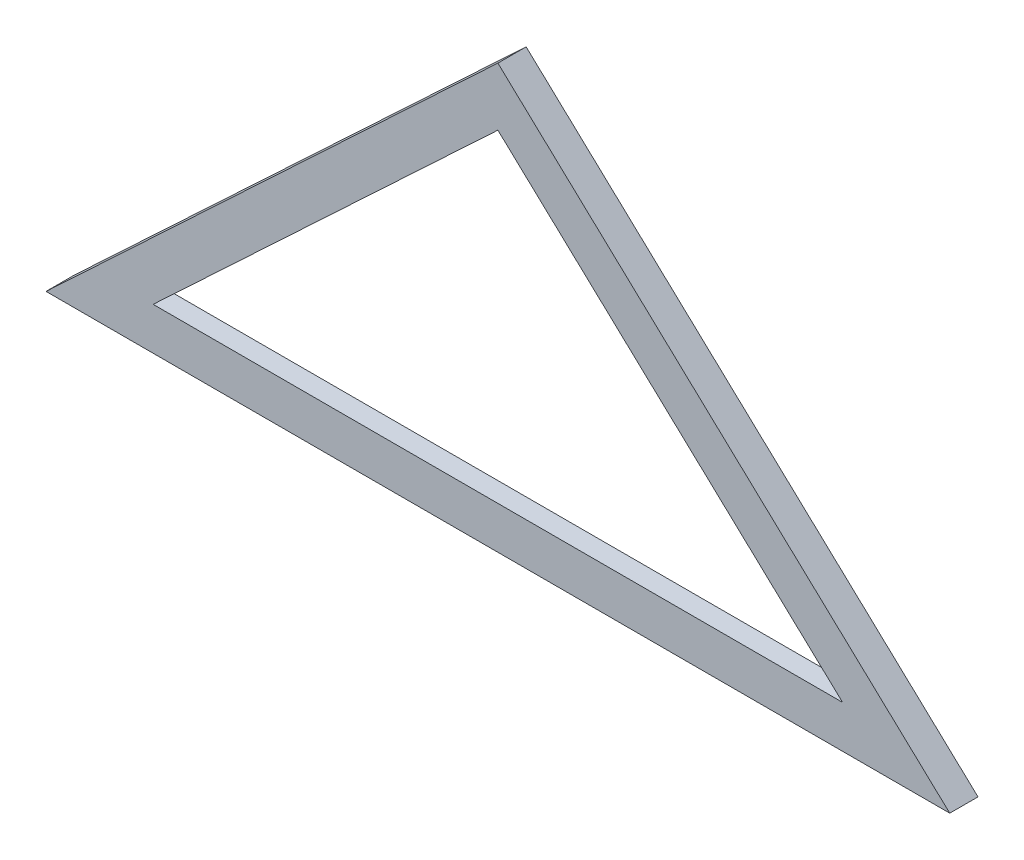
ISO-10303-21;
HEADER;
FILE_DESCRIPTION(('STEP AP214'),'2;1');
FILE_NAME('part.step','',(''),(''),'','','');
FILE_SCHEMA(('AUTOMOTIVE_DESIGN { 1 0 10303 214 1 1 1 1 }'));
ENDSEC;
DATA;
#1=APPLICATION_CONTEXT('core data for automotive mechanical design processes');
#2=APPLICATION_PROTOCOL_DEFINITION('international standard','automotive_design',2000,#1);
#3=PRODUCT_CONTEXT('',#1,'mechanical');
#4=PRODUCT('Part','Part','',(#3));
#5=PRODUCT_RELATED_PRODUCT_CATEGORY('part','',(#4));
#6=PRODUCT_DEFINITION_FORMATION('','',#4);
#7=PRODUCT_DEFINITION_CONTEXT('part definition',#1,'design');
#8=PRODUCT_DEFINITION('design','',#6,#7);
#9=PRODUCT_DEFINITION_SHAPE('','',#8);
#10=(LENGTH_UNIT() NAMED_UNIT(*) SI_UNIT(.MILLI.,.METRE.));
#11=(NAMED_UNIT(*) PLANE_ANGLE_UNIT() SI_UNIT($,.RADIAN.));
#12=(NAMED_UNIT(*) SI_UNIT($,.STERADIAN.) SOLID_ANGLE_UNIT());
#13=UNCERTAINTY_MEASURE_WITH_UNIT(LENGTH_MEASURE(1.E-05),#10,'distance_accuracy_value','');
#14=(GEOMETRIC_REPRESENTATION_CONTEXT(3) GLOBAL_UNCERTAINTY_ASSIGNED_CONTEXT((#13)) GLOBAL_UNIT_ASSIGNED_CONTEXT((#10,
#11,#12)) REPRESENTATION_CONTEXT('',''));
#15=CARTESIAN_POINT('',(0.,0.,0.));
#16=DIRECTION('',(0.,0.,1.));
#17=DIRECTION('',(1.,0.,0.));
#18=AXIS2_PLACEMENT_3D('',#15,#16,#17);
#19=CARTESIAN_POINT('',(0.,0.,10.));
#20=DIRECTION('',(0.,0.,-1.));
#21=DIRECTION('',(-1.,0.,0.));
#22=AXIS2_PLACEMENT_3D('',#19,#20,#21);
#23=PLANE('',#22);
#24=DIRECTION('',(-0.729537204140085,-0.68394112888133,0.));
#25=VECTOR('',#24,1.);
#26=CARTESIAN_POINT('',(0.,0.,10.));
#27=LINE('',#26,#25);
#28=CARTESIAN_POINT('',(160.,150.,10.));
#29=VERTEX_POINT('',#28);
#30=CARTESIAN_POINT('',(0.,0.,10.));
#31=VERTEX_POINT('',#30);
#32=EDGE_CURVE('E152',#29,#31,#27,.T.);
#33=ORIENTED_EDGE('',*,*,#32,.T.);
#34=DIRECTION('',(1.,0.,0.));
#35=VECTOR('',#34,1.);
#36=CARTESIAN_POINT('',(0.,0.,10.));
#37=LINE('',#36,#35);
#38=CARTESIAN_POINT('',(320.,0.,10.));
#39=VERTEX_POINT('',#38);
#40=EDGE_CURVE('E155',#31,#39,#37,.T.);
#41=ORIENTED_EDGE('',*,*,#40,.T.);
#42=DIRECTION('',(-0.729537204140085,0.68394112888133,0.));
#43=VECTOR('',#42,1.);
#44=CARTESIAN_POINT('',(160.,150.,10.));
#45=LINE('',#44,#43);
#46=EDGE_CURVE('E158',#39,#29,#45,.T.);
#47=ORIENTED_EDGE('',*,*,#46,.T.);
#48=EDGE_LOOP('',(#33,#41,#47));
#49=FACE_BOUND('',#48,.T.);
#50=DIRECTION('',(-0.729537204140085,-0.68394112888133,0.));
#51=VECTOR('',#50,1.);
#52=CARTESIAN_POINT('',(37.9317121994613,15.,10.));
#53=LINE('',#52,#51);
#54=CARTESIAN_POINT('',(160.,129.439019813005,10.));
#55=VERTEX_POINT('',#54);
#56=CARTESIAN_POINT('',(37.9317121994613,15.,10.));
#57=VERTEX_POINT('',#56);
#58=EDGE_CURVE('E135',#55,#57,#53,.T.);
#59=ORIENTED_EDGE('',*,*,#58,.F.);
#60=DIRECTION('',(-0.729537204140085,0.68394112888133,0.));
#61=VECTOR('',#60,1.);
#62=CARTESIAN_POINT('',(160.,129.439019813005,10.));
#63=LINE('',#62,#61);
#64=CARTESIAN_POINT('',(282.068287800539,15.,10.));
#65=VERTEX_POINT('',#64);
#66=EDGE_CURVE('E140',#65,#55,#63,.T.);
#67=ORIENTED_EDGE('',*,*,#66,.F.);
#68=DIRECTION('',(1.,0.,0.));
#69=VECTOR('',#68,1.);
#70=CARTESIAN_POINT('',(37.9317121994613,15.,10.));
#71=LINE('',#70,#69);
#72=EDGE_CURVE('E137',#57,#65,#71,.T.);
#73=ORIENTED_EDGE('',*,*,#72,.F.);
#74=EDGE_LOOP('',(#59,#67,#73));
#75=FACE_BOUND('',#74,.T.);
#76=ADVANCED_FACE('F33',(#49,#75),#23,.F.);
#77=CARTESIAN_POINT('',(0.,0.,0.));
#78=DIRECTION('',(0.,0.,-1.));
#79=DIRECTION('',(-1.,0.,0.));
#80=AXIS2_PLACEMENT_3D('',#77,#78,#79);
#81=PLANE('',#80);
#82=DIRECTION('',(0.729537204140085,-0.68394112888133,0.));
#83=VECTOR('',#82,1.);
#84=CARTESIAN_POINT('',(160.,136.292679875337,0.));
#85=LINE('',#84,#83);
#86=CARTESIAN_POINT('',(160.,136.292679875337,0.));
#87=VERTEX_POINT('',#86);
#88=CARTESIAN_POINT('',(294.712191867026,10.,0.));
#89=VERTEX_POINT('',#88);
#90=EDGE_CURVE('E48',#87,#89,#85,.T.);
#91=ORIENTED_EDGE('',*,*,#90,.F.);
#92=DIRECTION('',(0.729537204140085,0.68394112888133,0.));
#93=VECTOR('',#92,1.);
#94=CARTESIAN_POINT('',(25.2878081329742,10.,0.));
#95=LINE('',#94,#93);
#96=CARTESIAN_POINT('',(25.2878081329742,10.,0.));
#97=VERTEX_POINT('',#96);
#98=EDGE_CURVE('E120',#97,#87,#95,.T.);
#99=ORIENTED_EDGE('',*,*,#98,.F.);
#100=DIRECTION('',(-1.,0.,0.));
#101=VECTOR('',#100,1.);
#102=CARTESIAN_POINT('',(294.712191867026,10.,0.));
#103=LINE('',#102,#101);
#104=EDGE_CURVE('E123',#89,#97,#103,.T.);
#105=ORIENTED_EDGE('',*,*,#104,.F.);
#106=EDGE_LOOP('',(#91,#99,#105));
#107=FACE_BOUND('',#106,.T.);
#108=DIRECTION('',(-0.729537204140085,-0.68394112888133,0.));
#109=VECTOR('',#108,1.);
#110=CARTESIAN_POINT('',(0.,0.,0.));
#111=LINE('',#110,#109);
#112=CARTESIAN_POINT('',(160.,150.,0.));
#113=VERTEX_POINT('',#112);
#114=CARTESIAN_POINT('',(0.,0.,0.));
#115=VERTEX_POINT('',#114);
#116=EDGE_CURVE('E151',#113,#115,#111,.T.);
#117=ORIENTED_EDGE('',*,*,#116,.F.);
#118=DIRECTION('',(-0.729537204140085,0.68394112888133,0.));
#119=VECTOR('',#118,1.);
#120=CARTESIAN_POINT('',(160.,150.,0.));
#121=LINE('',#120,#119);
#122=CARTESIAN_POINT('',(320.,0.,0.));
#123=VERTEX_POINT('',#122);
#124=EDGE_CURVE('E156',#123,#113,#121,.T.);
#125=ORIENTED_EDGE('',*,*,#124,.F.);
#126=DIRECTION('',(1.,0.,0.));
#127=VECTOR('',#126,1.);
#128=CARTESIAN_POINT('',(0.,0.,0.));
#129=LINE('',#128,#127);
#130=EDGE_CURVE('E163',#115,#123,#129,.T.);
#131=ORIENTED_EDGE('',*,*,#130,.F.);
#132=EDGE_LOOP('',(#117,#125,#131));
#133=FACE_BOUND('',#132,.T.);
#134=ADVANCED_FACE('F181',(#107,#133),#81,.T.);
#135=CARTESIAN_POINT('',(0.,0.,10.));
#136=DIRECTION('',(0.68394112888133,-0.729537204140085,0.));
#137=DIRECTION('',(0.729537204140085,0.68394112888133,0.));
#138=AXIS2_PLACEMENT_3D('',#135,#136,#137);
#139=PLANE('',#138);
#140=ORIENTED_EDGE('',*,*,#116,.T.);
#141=DIRECTION('',(0.,0.,-1.));
#142=VECTOR('',#141,1.);
#143=CARTESIAN_POINT('',(0.,0.,10.));
#144=LINE('',#143,#142);
#145=EDGE_CURVE('E41',#31,#115,#144,.T.);
#146=ORIENTED_EDGE('',*,*,#145,.F.);
#147=ORIENTED_EDGE('',*,*,#32,.F.);
#148=DIRECTION('',(0.,0.,-1.));
#149=VECTOR('',#148,1.);
#150=CARTESIAN_POINT('',(160.,150.,10.));
#151=LINE('',#150,#149);
#152=EDGE_CURVE('E160',#29,#113,#151,.T.);
#153=ORIENTED_EDGE('',*,*,#152,.T.);
#154=EDGE_LOOP('',(#140,#146,#147,#153));
#155=FACE_BOUND('',#154,.T.);
#156=ADVANCED_FACE('F35',(#155),#139,.F.);
#157=CARTESIAN_POINT('',(0.,0.,10.));
#158=DIRECTION('',(0.,1.,0.));
#159=DIRECTION('',(0.,0.,1.));
#160=AXIS2_PLACEMENT_3D('',#157,#158,#159);
#161=PLANE('',#160);
#162=ORIENTED_EDGE('',*,*,#130,.T.);
#163=DIRECTION('',(0.,0.,-1.));
#164=VECTOR('',#163,1.);
#165=CARTESIAN_POINT('',(320.,0.,10.));
#166=LINE('',#165,#164);
#167=EDGE_CURVE('E168',#39,#123,#166,.T.);
#168=ORIENTED_EDGE('',*,*,#167,.F.);
#169=ORIENTED_EDGE('',*,*,#40,.F.);
#170=ORIENTED_EDGE('',*,*,#145,.T.);
#171=EDGE_LOOP('',(#162,#168,#169,#170));
#172=FACE_BOUND('',#171,.T.);
#173=ADVANCED_FACE('F173',(#172),#161,.F.);
#174=CARTESIAN_POINT('',(160.,150.,10.));
#175=DIRECTION('',(-0.68394112888133,-0.729537204140085,0.));
#176=DIRECTION('',(0.729537204140085,-0.68394112888133,0.));
#177=AXIS2_PLACEMENT_3D('',#174,#175,#176);
#178=PLANE('',#177);
#179=ORIENTED_EDGE('',*,*,#124,.T.);
#180=ORIENTED_EDGE('',*,*,#152,.F.);
#181=ORIENTED_EDGE('',*,*,#46,.F.);
#182=ORIENTED_EDGE('',*,*,#167,.T.);
#183=EDGE_LOOP('',(#179,#180,#181,#182));
#184=FACE_BOUND('',#183,.T.);
#185=ADVANCED_FACE('F183',(#184),#178,.F.);
#186=CARTESIAN_POINT('',(37.9317121994613,15.,10.));
#187=DIRECTION('',(0.68394112888133,-0.729537204140085,0.));
#188=DIRECTION('',(0.729537204140085,0.68394112888133,0.));
#189=AXIS2_PLACEMENT_3D('',#186,#187,#188);
#190=PLANE('',#189);
#191=DIRECTION('',(-0.729537204140085,-0.68394112888133,0.));
#192=VECTOR('',#191,1.);
#193=CARTESIAN_POINT('',(37.9317121994613,15.,3.));
#194=LINE('',#193,#192);
#195=CARTESIAN_POINT('',(160.,129.439019813005,3.));
#196=VERTEX_POINT('',#195);
#197=CARTESIAN_POINT('',(37.9317121994613,15.,3.));
#198=VERTEX_POINT('',#197);
#199=EDGE_CURVE('E133',#196,#198,#194,.T.);
#200=ORIENTED_EDGE('',*,*,#199,.F.);
#201=DIRECTION('',(0.,0.,-1.));
#202=VECTOR('',#201,1.);
#203=CARTESIAN_POINT('',(160.,129.439019813005,10.));
#204=LINE('',#203,#202);
#205=EDGE_CURVE('E142',#55,#196,#204,.T.);
#206=ORIENTED_EDGE('',*,*,#205,.F.);
#207=ORIENTED_EDGE('',*,*,#58,.T.);
#208=DIRECTION('',(0.,0.,-1.));
#209=VECTOR('',#208,1.);
#210=CARTESIAN_POINT('',(37.9317121994613,15.,10.));
#211=LINE('',#210,#209);
#212=EDGE_CURVE('E148',#57,#198,#211,.T.);
#213=ORIENTED_EDGE('',*,*,#212,.T.);
#214=EDGE_LOOP('',(#200,#206,#207,#213));
#215=FACE_BOUND('',#214,.T.);
#216=ADVANCED_FACE('F196',(#215),#190,.T.);
#217=CARTESIAN_POINT('',(37.9317121994613,15.,10.));
#218=DIRECTION('',(0.,1.,0.));
#219=DIRECTION('',(0.,0.,1.));
#220=AXIS2_PLACEMENT_3D('',#217,#218,#219);
#221=PLANE('',#220);
#222=DIRECTION('',(1.,0.,0.));
#223=VECTOR('',#222,1.);
#224=CARTESIAN_POINT('',(37.9317121994613,15.,3.));
#225=LINE('',#224,#223);
#226=CARTESIAN_POINT('',(282.068287800539,15.,3.));
#227=VERTEX_POINT('',#226);
#228=EDGE_CURVE('E55',#198,#227,#225,.T.);
#229=ORIENTED_EDGE('',*,*,#228,.F.);
#230=ORIENTED_EDGE('',*,*,#212,.F.);
#231=ORIENTED_EDGE('',*,*,#72,.T.);
#232=DIRECTION('',(0.,0.,-1.));
#233=VECTOR('',#232,1.);
#234=CARTESIAN_POINT('',(282.068287800539,15.,10.));
#235=LINE('',#234,#233);
#236=EDGE_CURVE('E145',#65,#227,#235,.T.);
#237=ORIENTED_EDGE('',*,*,#236,.T.);
#238=EDGE_LOOP('',(#229,#230,#231,#237));
#239=FACE_BOUND('',#238,.T.);
#240=ADVANCED_FACE('F198',(#239),#221,.T.);
#241=CARTESIAN_POINT('',(160.,129.439019813005,10.));
#242=DIRECTION('',(-0.68394112888133,-0.729537204140085,0.));
#243=DIRECTION('',(0.729537204140085,-0.68394112888133,0.));
#244=AXIS2_PLACEMENT_3D('',#241,#242,#243);
#245=PLANE('',#244);
#246=DIRECTION('',(-0.729537204140085,0.68394112888133,0.));
#247=VECTOR('',#246,1.);
#248=CARTESIAN_POINT('',(160.,129.439019813005,3.));
#249=LINE('',#248,#247);
#250=EDGE_CURVE('E11',#227,#196,#249,.T.);
#251=ORIENTED_EDGE('',*,*,#250,.F.);
#252=ORIENTED_EDGE('',*,*,#236,.F.);
#253=ORIENTED_EDGE('',*,*,#66,.T.);
#254=ORIENTED_EDGE('',*,*,#205,.T.);
#255=EDGE_LOOP('',(#251,#252,#253,#254));
#256=FACE_BOUND('',#255,.T.);
#257=ADVANCED_FACE('F200',(#256),#245,.T.);
#258=CARTESIAN_POINT('',(160.,136.292679875337,3.));
#259=DIRECTION('',(0.68394112888133,0.729537204140085,0.));
#260=DIRECTION('',(-0.729537204140085,0.68394112888133,0.));
#261=AXIS2_PLACEMENT_3D('',#258,#259,#260);
#262=PLANE('',#261);
#263=ORIENTED_EDGE('',*,*,#90,.T.);
#264=DIRECTION('',(0.,0.,-1.));
#265=VECTOR('',#264,1.);
#266=CARTESIAN_POINT('',(294.712191867026,10.,3.));
#267=LINE('',#266,#265);
#268=CARTESIAN_POINT('',(294.712191867026,10.,3.));
#269=VERTEX_POINT('',#268);
#270=EDGE_CURVE('E101',#269,#89,#267,.T.);
#271=ORIENTED_EDGE('',*,*,#270,.F.);
#272=DIRECTION('',(0.729537204140085,-0.68394112888133,0.));
#273=VECTOR('',#272,1.);
#274=CARTESIAN_POINT('',(160.,136.292679875337,3.));
#275=LINE('',#274,#273);
#276=CARTESIAN_POINT('',(160.,136.292679875337,3.));
#277=VERTEX_POINT('',#276);
#278=EDGE_CURVE('E105',#277,#269,#275,.T.);
#279=ORIENTED_EDGE('',*,*,#278,.F.);
#280=DIRECTION('',(0.,0.,-1.));
#281=VECTOR('',#280,1.);
#282=CARTESIAN_POINT('',(160.,136.292679875337,3.));
#283=LINE('',#282,#281);
#284=EDGE_CURVE('E129',#277,#87,#283,.T.);
#285=ORIENTED_EDGE('',*,*,#284,.T.);
#286=EDGE_LOOP('',(#263,#271,#279,#285));
#287=FACE_BOUND('',#286,.T.);
#288=ADVANCED_FACE('F103',(#287),#262,.F.);
#289=CARTESIAN_POINT('',(25.2878081329742,10.,3.));
#290=DIRECTION('',(-0.68394112888133,0.729537204140085,0.));
#291=DIRECTION('',(-0.729537204140085,-0.68394112888133,0.));
#292=AXIS2_PLACEMENT_3D('',#289,#290,#291);
#293=PLANE('',#292);
#294=ORIENTED_EDGE('',*,*,#98,.T.);
#295=ORIENTED_EDGE('',*,*,#284,.F.);
#296=DIRECTION('',(0.729537204140085,0.68394112888133,0.));
#297=VECTOR('',#296,1.);
#298=CARTESIAN_POINT('',(25.2878081329742,10.,3.));
#299=LINE('',#298,#297);
#300=CARTESIAN_POINT('',(25.2878081329742,10.,3.));
#301=VERTEX_POINT('',#300);
#302=EDGE_CURVE('E111',#301,#277,#299,.T.);
#303=ORIENTED_EDGE('',*,*,#302,.F.);
#304=DIRECTION('',(0.,0.,-1.));
#305=VECTOR('',#304,1.);
#306=CARTESIAN_POINT('',(25.2878081329742,10.,3.));
#307=LINE('',#306,#305);
#308=EDGE_CURVE('E110',#301,#97,#307,.T.);
#309=ORIENTED_EDGE('',*,*,#308,.T.);
#310=EDGE_LOOP('',(#294,#295,#303,#309));
#311=FACE_BOUND('',#310,.T.);
#312=ADVANCED_FACE('F206',(#311),#293,.F.);
#313=CARTESIAN_POINT('',(294.712191867026,10.,3.));
#314=DIRECTION('',(0.,-1.,0.));
#315=DIRECTION('',(1.,0.,0.));
#316=AXIS2_PLACEMENT_3D('',#313,#314,#315);
#317=PLANE('',#316);
#318=ORIENTED_EDGE('',*,*,#104,.T.);
#319=ORIENTED_EDGE('',*,*,#308,.F.);
#320=DIRECTION('',(-1.,0.,0.));
#321=VECTOR('',#320,1.);
#322=CARTESIAN_POINT('',(294.712191867026,10.,3.));
#323=LINE('',#322,#321);
#324=EDGE_CURVE('E114',#269,#301,#323,.T.);
#325=ORIENTED_EDGE('',*,*,#324,.F.);
#326=ORIENTED_EDGE('',*,*,#270,.T.);
#327=EDGE_LOOP('',(#318,#319,#325,#326));
#328=FACE_BOUND('',#327,.T.);
#329=ADVANCED_FACE('F115',(#328),#317,.F.);
#330=CARTESIAN_POINT('',(0.,0.,3.));
#331=DIRECTION('',(0.,0.,1.));
#332=DIRECTION('',(1.,0.,0.));
#333=AXIS2_PLACEMENT_3D('',#330,#331,#332);
#334=PLANE('',#333);
#335=ORIENTED_EDGE('',*,*,#199,.T.);
#336=ORIENTED_EDGE('',*,*,#228,.T.);
#337=ORIENTED_EDGE('',*,*,#250,.T.);
#338=EDGE_LOOP('',(#335,#336,#337));
#339=FACE_BOUND('',#338,.T.);
#340=ORIENTED_EDGE('',*,*,#278,.T.);
#341=ORIENTED_EDGE('',*,*,#324,.T.);
#342=ORIENTED_EDGE('',*,*,#302,.T.);
#343=EDGE_LOOP('',(#340,#341,#342));
#344=FACE_BOUND('',#343,.T.);
#345=ADVANCED_FACE('F119',(#339,#344),#334,.F.);
#346=CLOSED_SHELL('',(#76,#134,#156,#173,#185,#216,#240,#257,#288,#312,#329,#345));
#347=MANIFOLD_SOLID_BREP('B2',#346);
#348=ADVANCED_BREP_SHAPE_REPRESENTATION('',(#18,#347),#14);
#349=SHAPE_DEFINITION_REPRESENTATION(#9,#348);
ENDSEC;
END-ISO-10303-21;
